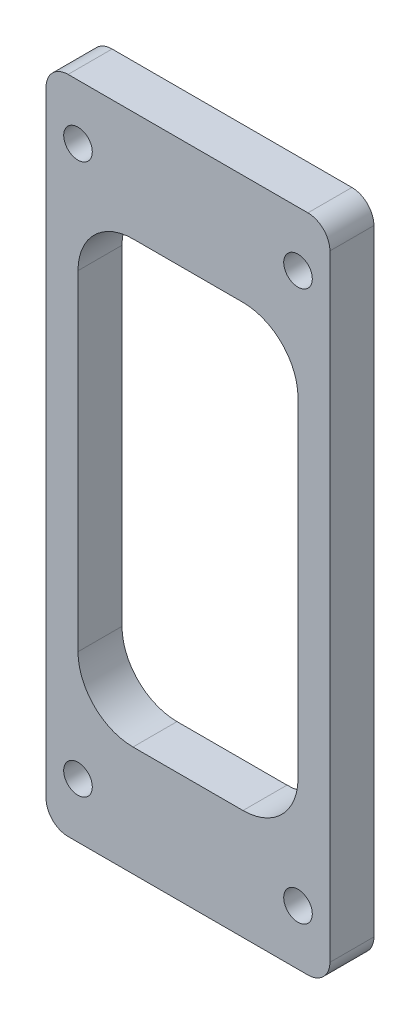
ISO-10303-21;
HEADER;
FILE_DESCRIPTION(('STEP AP214'),'2;1');
FILE_NAME('part.step','',(''),(''),'','','');
FILE_SCHEMA(('AUTOMOTIVE_DESIGN { 1 0 10303 214 1 1 1 1 }'));
ENDSEC;
DATA;
#1=APPLICATION_CONTEXT('core data for automotive mechanical design processes');
#2=APPLICATION_PROTOCOL_DEFINITION('international standard','automotive_design',2000,#1);
#3=PRODUCT_CONTEXT('',#1,'mechanical');
#4=PRODUCT('Part','Part','',(#3));
#5=PRODUCT_RELATED_PRODUCT_CATEGORY('part','',(#4));
#6=PRODUCT_DEFINITION_FORMATION('','',#4);
#7=PRODUCT_DEFINITION_CONTEXT('part definition',#1,'design');
#8=PRODUCT_DEFINITION('design','',#6,#7);
#9=PRODUCT_DEFINITION_SHAPE('','',#8);
#10=(LENGTH_UNIT() NAMED_UNIT(*) SI_UNIT(.MILLI.,.METRE.));
#11=(NAMED_UNIT(*) PLANE_ANGLE_UNIT() SI_UNIT($,.RADIAN.));
#12=(NAMED_UNIT(*) SI_UNIT($,.STERADIAN.) SOLID_ANGLE_UNIT());
#13=UNCERTAINTY_MEASURE_WITH_UNIT(LENGTH_MEASURE(1.E-05),#10,'distance_accuracy_value','');
#14=(GEOMETRIC_REPRESENTATION_CONTEXT(3) GLOBAL_UNCERTAINTY_ASSIGNED_CONTEXT((#13)) GLOBAL_UNIT_ASSIGNED_CONTEXT((#10,
#11,#12)) REPRESENTATION_CONTEXT('',''));
#15=CARTESIAN_POINT('',(0.,0.,0.));
#16=DIRECTION('',(0.,0.,1.));
#17=DIRECTION('',(1.,0.,0.));
#18=AXIS2_PLACEMENT_3D('',#15,#16,#17);
#19=CARTESIAN_POINT('',(12.9,30.,4.));
#20=DIRECTION('',(-1.,0.,0.));
#21=DIRECTION('',(0.,-1.,0.));
#22=AXIS2_PLACEMENT_3D('',#19,#20,#21);
#23=PLANE('',#22);
#24=DIRECTION('',(0.,1.,0.));
#25=VECTOR('',#24,1.);
#26=CARTESIAN_POINT('',(12.9,30.,4.));
#27=LINE('',#26,#25);
#28=CARTESIAN_POINT('',(12.9,-28.,4.));
#29=VERTEX_POINT('',#28);
#30=CARTESIAN_POINT('',(12.9,28.,4.));
#31=VERTEX_POINT('',#30);
#32=EDGE_CURVE('E242',#29,#31,#27,.T.);
#33=ORIENTED_EDGE('',*,*,#32,.F.);
#34=DIRECTION('',(0.,0.,-1.));
#35=VECTOR('',#34,1.);
#36=CARTESIAN_POINT('',(12.9,-28.,4.));
#37=LINE('',#36,#35);
#38=CARTESIAN_POINT('',(12.9,-28.,0.));
#39=VERTEX_POINT('',#38);
#40=EDGE_CURVE('E12',#29,#39,#37,.T.);
#41=ORIENTED_EDGE('',*,*,#40,.T.);
#42=DIRECTION('',(0.,1.,0.));
#43=VECTOR('',#42,1.);
#44=CARTESIAN_POINT('',(12.9,30.,0.));
#45=LINE('',#44,#43);
#46=CARTESIAN_POINT('',(12.9,28.,0.));
#47=VERTEX_POINT('',#46);
#48=EDGE_CURVE('E240',#39,#47,#45,.T.);
#49=ORIENTED_EDGE('',*,*,#48,.T.);
#50=DIRECTION('',(0.,0.,-1.));
#51=VECTOR('',#50,1.);
#52=CARTESIAN_POINT('',(12.9,28.,4.));
#53=LINE('',#52,#51);
#54=EDGE_CURVE('E51',#47,#31,#53,.F.);
#55=ORIENTED_EDGE('',*,*,#54,.T.);
#56=EDGE_LOOP('',(#33,#41,#49,#55));
#57=FACE_BOUND('',#56,.T.);
#58=ADVANCED_FACE('F43',(#57),#23,.F.);
#59=CARTESIAN_POINT('',(-12.9,30.,4.));
#60=DIRECTION('',(0.,-1.,0.));
#61=DIRECTION('',(0.,0.,-1.));
#62=AXIS2_PLACEMENT_3D('',#59,#60,#61);
#63=PLANE('',#62);
#64=DIRECTION('',(-1.,0.,0.));
#65=VECTOR('',#64,1.);
#66=CARTESIAN_POINT('',(-12.9,30.,0.));
#67=LINE('',#66,#65);
#68=CARTESIAN_POINT('',(10.9,30.,0.));
#69=VERTEX_POINT('',#68);
#70=CARTESIAN_POINT('',(-10.9,30.,0.));
#71=VERTEX_POINT('',#70);
#72=EDGE_CURVE('E259',#69,#71,#67,.T.);
#73=ORIENTED_EDGE('',*,*,#72,.T.);
#74=DIRECTION('',(0.,0.,-1.));
#75=VECTOR('',#74,1.);
#76=CARTESIAN_POINT('',(-10.9,30.,4.));
#77=LINE('',#76,#75);
#78=CARTESIAN_POINT('',(-10.9,30.,4.));
#79=VERTEX_POINT('',#78);
#80=EDGE_CURVE('E296',#71,#79,#77,.F.);
#81=ORIENTED_EDGE('',*,*,#80,.T.);
#82=DIRECTION('',(-1.,0.,0.));
#83=VECTOR('',#82,1.);
#84=CARTESIAN_POINT('',(-12.9,30.,4.));
#85=LINE('',#84,#83);
#86=CARTESIAN_POINT('',(10.9,30.,4.));
#87=VERTEX_POINT('',#86);
#88=EDGE_CURVE('E246',#87,#79,#85,.T.);
#89=ORIENTED_EDGE('',*,*,#88,.F.);
#90=DIRECTION('',(0.,0.,-1.));
#91=VECTOR('',#90,1.);
#92=CARTESIAN_POINT('',(10.9,30.,4.));
#93=LINE('',#92,#91);
#94=EDGE_CURVE('E293',#87,#69,#93,.T.);
#95=ORIENTED_EDGE('',*,*,#94,.T.);
#96=EDGE_LOOP('',(#73,#81,#89,#95));
#97=FACE_BOUND('',#96,.T.);
#98=ADVANCED_FACE('F311',(#97),#63,.F.);
#99=CARTESIAN_POINT('',(-12.9,30.,4.));
#100=DIRECTION('',(1.,0.,0.));
#101=DIRECTION('',(0.,1.,0.));
#102=AXIS2_PLACEMENT_3D('',#99,#100,#101);
#103=PLANE('',#102);
#104=DIRECTION('',(0.,-1.,0.));
#105=VECTOR('',#104,1.);
#106=CARTESIAN_POINT('',(-12.9,30.,0.));
#107=LINE('',#106,#105);
#108=CARTESIAN_POINT('',(-12.9,28.,0.));
#109=VERTEX_POINT('',#108);
#110=CARTESIAN_POINT('',(-12.9,-28.,0.));
#111=VERTEX_POINT('',#110);
#112=EDGE_CURVE('E262',#109,#111,#107,.T.);
#113=ORIENTED_EDGE('',*,*,#112,.T.);
#114=DIRECTION('',(0.,0.,-1.));
#115=VECTOR('',#114,1.);
#116=CARTESIAN_POINT('',(-12.9,-28.,4.));
#117=LINE('',#116,#115);
#118=CARTESIAN_POINT('',(-12.9,-28.,4.));
#119=VERTEX_POINT('',#118);
#120=EDGE_CURVE('E283',#111,#119,#117,.F.);
#121=ORIENTED_EDGE('',*,*,#120,.T.);
#122=DIRECTION('',(0.,-1.,0.));
#123=VECTOR('',#122,1.);
#124=CARTESIAN_POINT('',(-12.9,30.,4.));
#125=LINE('',#124,#123);
#126=CARTESIAN_POINT('',(-12.9,28.,4.));
#127=VERTEX_POINT('',#126);
#128=EDGE_CURVE('E250',#127,#119,#125,.T.);
#129=ORIENTED_EDGE('',*,*,#128,.F.);
#130=DIRECTION('',(0.,0.,-1.));
#131=VECTOR('',#130,1.);
#132=CARTESIAN_POINT('',(-12.9,28.,4.));
#133=LINE('',#132,#131);
#134=EDGE_CURVE('E280',#127,#109,#133,.T.);
#135=ORIENTED_EDGE('',*,*,#134,.T.);
#136=EDGE_LOOP('',(#113,#121,#129,#135));
#137=FACE_BOUND('',#136,.T.);
#138=ADVANCED_FACE('F322',(#137),#103,.F.);
#139=CARTESIAN_POINT('',(-12.9,-30.,4.));
#140=DIRECTION('',(0.,1.,0.));
#141=DIRECTION('',(0.,0.,1.));
#142=AXIS2_PLACEMENT_3D('',#139,#140,#141);
#143=PLANE('',#142);
#144=DIRECTION('',(1.,0.,0.));
#145=VECTOR('',#144,1.);
#146=CARTESIAN_POINT('',(-12.9,-30.,4.));
#147=LINE('',#146,#145);
#148=CARTESIAN_POINT('',(-10.9,-30.,4.));
#149=VERTEX_POINT('',#148);
#150=CARTESIAN_POINT('',(10.9,-30.,4.));
#151=VERTEX_POINT('',#150);
#152=EDGE_CURVE('E253',#149,#151,#147,.T.);
#153=ORIENTED_EDGE('',*,*,#152,.F.);
#154=DIRECTION('',(0.,0.,-1.));
#155=VECTOR('',#154,1.);
#156=CARTESIAN_POINT('',(-10.9,-30.,4.));
#157=LINE('',#156,#155);
#158=CARTESIAN_POINT('',(-10.9,-30.,0.));
#159=VERTEX_POINT('',#158);
#160=EDGE_CURVE('E268',#149,#159,#157,.T.);
#161=ORIENTED_EDGE('',*,*,#160,.T.);
#162=DIRECTION('',(1.,0.,0.));
#163=VECTOR('',#162,1.);
#164=CARTESIAN_POINT('',(-12.9,-30.,0.));
#165=LINE('',#164,#163);
#166=CARTESIAN_POINT('',(10.9,-30.,0.));
#167=VERTEX_POINT('',#166);
#168=EDGE_CURVE('E247',#159,#167,#165,.T.);
#169=ORIENTED_EDGE('',*,*,#168,.T.);
#170=DIRECTION('',(0.,0.,-1.));
#171=VECTOR('',#170,1.);
#172=CARTESIAN_POINT('',(10.9,-30.,4.));
#173=LINE('',#172,#171);
#174=EDGE_CURVE('E256',#167,#151,#173,.F.);
#175=ORIENTED_EDGE('',*,*,#174,.T.);
#176=EDGE_LOOP('',(#153,#161,#169,#175));
#177=FACE_BOUND('',#176,.T.);
#178=ADVANCED_FACE('F330',(#177),#143,.F.);
#179=CARTESIAN_POINT('',(0.,0.,4.));
#180=DIRECTION('',(0.,0.,1.));
#181=DIRECTION('',(1.,0.,0.));
#182=AXIS2_PLACEMENT_3D('',#179,#180,#181);
#183=PLANE('',#182);
#184=CARTESIAN_POINT('',(5.,15.,4.));
#185=DIRECTION('',(0.,0.,1.));
#186=DIRECTION('',(-1.,0.,0.));
#187=AXIS2_PLACEMENT_3D('',#184,#185,#186);
#188=CIRCLE('',#187,5.);
#189=CARTESIAN_POINT('',(10.,15.,4.));
#190=VERTEX_POINT('',#189);
#191=CARTESIAN_POINT('',(4.99999999999996,20.,4.));
#192=VERTEX_POINT('',#191);
#193=EDGE_CURVE('E58',#190,#192,#188,.T.);
#194=ORIENTED_EDGE('',*,*,#193,.F.);
#195=DIRECTION('',(0.,1.,0.));
#196=VECTOR('',#195,1.);
#197=CARTESIAN_POINT('',(10.,15.,4.));
#198=LINE('',#197,#196);
#199=CARTESIAN_POINT('',(10.,-15.,4.));
#200=VERTEX_POINT('',#199);
#201=EDGE_CURVE('E164',#200,#190,#198,.T.);
#202=ORIENTED_EDGE('',*,*,#201,.F.);
#203=CARTESIAN_POINT('',(5.,-15.,4.));
#204=DIRECTION('',(0.,0.,1.));
#205=DIRECTION('',(1.,0.,0.));
#206=AXIS2_PLACEMENT_3D('',#203,#204,#205);
#207=CIRCLE('',#206,5.);
#208=CARTESIAN_POINT('',(4.99999999999997,-20.,4.));
#209=VERTEX_POINT('',#208);
#210=EDGE_CURVE('E199',#209,#200,#207,.T.);
#211=ORIENTED_EDGE('',*,*,#210,.F.);
#212=DIRECTION('',(1.,0.,0.));
#213=VECTOR('',#212,1.);
#214=CARTESIAN_POINT('',(4.99999999999997,-20.,4.));
#215=LINE('',#214,#213);
#216=CARTESIAN_POINT('',(-4.99999999999996,-20.,4.));
#217=VERTEX_POINT('',#216);
#218=EDGE_CURVE('E196',#217,#209,#215,.T.);
#219=ORIENTED_EDGE('',*,*,#218,.F.);
#220=CARTESIAN_POINT('',(-5.,-15.,4.));
#221=DIRECTION('',(0.,0.,1.));
#222=DIRECTION('',(-1.,0.,0.));
#223=AXIS2_PLACEMENT_3D('',#220,#221,#222);
#224=CIRCLE('',#223,5.);
#225=CARTESIAN_POINT('',(-10.,-15.,4.));
#226=VERTEX_POINT('',#225);
#227=EDGE_CURVE('E193',#226,#217,#224,.T.);
#228=ORIENTED_EDGE('',*,*,#227,.F.);
#229=DIRECTION('',(0.,-1.,0.));
#230=VECTOR('',#229,1.);
#231=CARTESIAN_POINT('',(-10.,15.,4.));
#232=LINE('',#231,#230);
#233=CARTESIAN_POINT('',(-10.,15.,4.));
#234=VERTEX_POINT('',#233);
#235=EDGE_CURVE('E190',#234,#226,#232,.T.);
#236=ORIENTED_EDGE('',*,*,#235,.F.);
#237=CARTESIAN_POINT('',(-5.,15.,4.));
#238=DIRECTION('',(0.,0.,1.));
#239=DIRECTION('',(1.,0.,0.));
#240=AXIS2_PLACEMENT_3D('',#237,#238,#239);
#241=CIRCLE('',#240,5.);
#242=CARTESIAN_POINT('',(-4.99999999999996,20.,4.));
#243=VERTEX_POINT('',#242);
#244=EDGE_CURVE('E187',#243,#234,#241,.T.);
#245=ORIENTED_EDGE('',*,*,#244,.F.);
#246=DIRECTION('',(-1.,0.,0.));
#247=VECTOR('',#246,1.);
#248=CARTESIAN_POINT('',(4.99999999999996,20.,4.));
#249=LINE('',#248,#247);
#250=EDGE_CURVE('E180',#192,#243,#249,.T.);
#251=ORIENTED_EDGE('',*,*,#250,.F.);
#252=EDGE_LOOP('',(#194,#202,#211,#219,#228,#236,#245,#251));
#253=FACE_BOUND('',#252,.T.);
#254=CARTESIAN_POINT('',(-10.,25.,4.));
#255=DIRECTION('',(0.,0.,1.));
#256=DIRECTION('',(1.,0.,0.));
#257=AXIS2_PLACEMENT_3D('',#254,#255,#256);
#258=CIRCLE('',#257,1.29999999999999);
#259=CARTESIAN_POINT('',(-8.70000000000002,25.,4.));
#260=VERTEX_POINT('',#259);
#261=EDGE_CURVE('E171',#260,#260,#258,.T.);
#262=ORIENTED_EDGE('',*,*,#261,.F.);
#263=EDGE_LOOP('',(#262));
#264=FACE_BOUND('',#263,.T.);
#265=CARTESIAN_POINT('',(10.,25.,4.));
#266=DIRECTION('',(0.,0.,1.));
#267=DIRECTION('',(1.,0.,0.));
#268=AXIS2_PLACEMENT_3D('',#265,#266,#267);
#269=CIRCLE('',#268,1.29999999999999);
#270=CARTESIAN_POINT('',(11.3,25.,4.));
#271=VERTEX_POINT('',#270);
#272=EDGE_CURVE('E224',#271,#271,#269,.T.);
#273=ORIENTED_EDGE('',*,*,#272,.F.);
#274=EDGE_LOOP('',(#273));
#275=FACE_BOUND('',#274,.T.);
#276=CARTESIAN_POINT('',(10.,-25.,4.));
#277=DIRECTION('',(0.,0.,1.));
#278=DIRECTION('',(1.,0.,0.));
#279=AXIS2_PLACEMENT_3D('',#276,#277,#278);
#280=CIRCLE('',#279,1.29999999999999);
#281=CARTESIAN_POINT('',(11.3,-25.,4.));
#282=VERTEX_POINT('',#281);
#283=EDGE_CURVE('E565',#282,#282,#280,.T.);
#284=ORIENTED_EDGE('',*,*,#283,.F.);
#285=EDGE_LOOP('',(#284));
#286=FACE_BOUND('',#285,.T.);
#287=CARTESIAN_POINT('',(-10.,-25.,4.));
#288=DIRECTION('',(0.,0.,1.));
#289=DIRECTION('',(1.,0.,0.));
#290=AXIS2_PLACEMENT_3D('',#287,#288,#289);
#291=CIRCLE('',#290,1.29999999999999);
#292=CARTESIAN_POINT('',(-8.70000000000001,-25.,4.));
#293=VERTEX_POINT('',#292);
#294=EDGE_CURVE('E241',#293,#293,#291,.T.);
#295=ORIENTED_EDGE('',*,*,#294,.F.);
#296=EDGE_LOOP('',(#295));
#297=FACE_BOUND('',#296,.T.);
#298=ORIENTED_EDGE('',*,*,#128,.T.);
#299=CARTESIAN_POINT('',(-10.9,-28.,4.));
#300=DIRECTION('',(0.,0.,1.));
#301=DIRECTION('',(1.,0.,0.));
#302=AXIS2_PLACEMENT_3D('',#299,#300,#301);
#303=CIRCLE('',#302,2.);
#304=EDGE_CURVE('E291',#119,#149,#303,.T.);
#305=ORIENTED_EDGE('',*,*,#304,.T.);
#306=ORIENTED_EDGE('',*,*,#152,.T.);
#307=CARTESIAN_POINT('',(10.9,-28.,4.));
#308=DIRECTION('',(0.,0.,1.));
#309=DIRECTION('',(1.,0.,0.));
#310=AXIS2_PLACEMENT_3D('',#307,#308,#309);
#311=CIRCLE('',#310,2.);
#312=EDGE_CURVE('E287',#151,#29,#311,.T.);
#313=ORIENTED_EDGE('',*,*,#312,.T.);
#314=ORIENTED_EDGE('',*,*,#32,.T.);
#315=CARTESIAN_POINT('',(10.9,28.,4.));
#316=DIRECTION('',(0.,0.,1.));
#317=DIRECTION('',(1.,0.,0.));
#318=AXIS2_PLACEMENT_3D('',#315,#316,#317);
#319=CIRCLE('',#318,2.);
#320=EDGE_CURVE('E285',#31,#87,#319,.T.);
#321=ORIENTED_EDGE('',*,*,#320,.T.);
#322=ORIENTED_EDGE('',*,*,#88,.T.);
#323=CARTESIAN_POINT('',(-10.9,28.,4.));
#324=DIRECTION('',(0.,0.,1.));
#325=DIRECTION('',(1.,0.,0.));
#326=AXIS2_PLACEMENT_3D('',#323,#324,#325);
#327=CIRCLE('',#326,2.);
#328=EDGE_CURVE('E289',#79,#127,#327,.T.);
#329=ORIENTED_EDGE('',*,*,#328,.T.);
#330=EDGE_LOOP('',(#298,#305,#306,#313,#314,#321,#322,#329));
#331=FACE_BOUND('',#330,.T.);
#332=ADVANCED_FACE('F305',(#253,#264,#275,#286,#297,#331),#183,.T.);
#333=CARTESIAN_POINT('',(0.,0.,0.));
#334=DIRECTION('',(0.,0.,1.));
#335=DIRECTION('',(1.,0.,0.));
#336=AXIS2_PLACEMENT_3D('',#333,#334,#335);
#337=PLANE('',#336);
#338=DIRECTION('',(0.,-1.,0.));
#339=VECTOR('',#338,1.);
#340=CARTESIAN_POINT('',(10.,15.,0.));
#341=LINE('',#340,#339);
#342=CARTESIAN_POINT('',(10.,15.,0.));
#343=VERTEX_POINT('',#342);
#344=CARTESIAN_POINT('',(10.,-15.,0.));
#345=VERTEX_POINT('',#344);
#346=EDGE_CURVE('E178',#343,#345,#341,.T.);
#347=ORIENTED_EDGE('',*,*,#346,.F.);
#348=CARTESIAN_POINT('',(5.,15.,0.));
#349=DIRECTION('',(0.,0.,1.));
#350=DIRECTION('',(1.,0.,0.));
#351=AXIS2_PLACEMENT_3D('',#348,#349,#350);
#352=CIRCLE('',#351,5.);
#353=CARTESIAN_POINT('',(4.99999999999996,20.,0.));
#354=VERTEX_POINT('',#353);
#355=EDGE_CURVE('E158',#354,#343,#352,.F.);
#356=ORIENTED_EDGE('',*,*,#355,.F.);
#357=DIRECTION('',(1.,0.,0.));
#358=VECTOR('',#357,1.);
#359=CARTESIAN_POINT('',(4.99999999999996,20.,0.));
#360=LINE('',#359,#358);
#361=CARTESIAN_POINT('',(-4.99999999999996,20.,0.));
#362=VERTEX_POINT('',#361);
#363=EDGE_CURVE('E167',#362,#354,#360,.T.);
#364=ORIENTED_EDGE('',*,*,#363,.F.);
#365=CARTESIAN_POINT('',(-5.,15.,0.));
#366=DIRECTION('',(0.,0.,1.));
#367=DIRECTION('',(1.,0.,0.));
#368=AXIS2_PLACEMENT_3D('',#365,#366,#367);
#369=CIRCLE('',#368,5.);
#370=CARTESIAN_POINT('',(-10.,15.,0.));
#371=VERTEX_POINT('',#370);
#372=EDGE_CURVE('E66',#371,#362,#369,.F.);
#373=ORIENTED_EDGE('',*,*,#372,.F.);
#374=DIRECTION('',(0.,1.,0.));
#375=VECTOR('',#374,1.);
#376=CARTESIAN_POINT('',(-10.,15.,0.));
#377=LINE('',#376,#375);
#378=CARTESIAN_POINT('',(-10.,-15.,0.));
#379=VERTEX_POINT('',#378);
#380=EDGE_CURVE('E535',#379,#371,#377,.T.);
#381=ORIENTED_EDGE('',*,*,#380,.F.);
#382=CARTESIAN_POINT('',(-5.,-15.,0.));
#383=DIRECTION('',(0.,0.,1.));
#384=DIRECTION('',(1.,0.,0.));
#385=AXIS2_PLACEMENT_3D('',#382,#383,#384);
#386=CIRCLE('',#385,5.);
#387=CARTESIAN_POINT('',(-4.99999999999996,-20.,0.));
#388=VERTEX_POINT('',#387);
#389=EDGE_CURVE('E539',#388,#379,#386,.F.);
#390=ORIENTED_EDGE('',*,*,#389,.F.);
#391=DIRECTION('',(-1.,0.,0.));
#392=VECTOR('',#391,1.);
#393=CARTESIAN_POINT('',(4.99999999999997,-20.,0.));
#394=LINE('',#393,#392);
#395=CARTESIAN_POINT('',(4.99999999999997,-20.,0.));
#396=VERTEX_POINT('',#395);
#397=EDGE_CURVE('E546',#396,#388,#394,.T.);
#398=ORIENTED_EDGE('',*,*,#397,.F.);
#399=CARTESIAN_POINT('',(5.,-15.,0.));
#400=DIRECTION('',(0.,0.,1.));
#401=DIRECTION('',(1.,0.,0.));
#402=AXIS2_PLACEMENT_3D('',#399,#400,#401);
#403=CIRCLE('',#402,5.);
#404=EDGE_CURVE('E182',#345,#396,#403,.F.);
#405=ORIENTED_EDGE('',*,*,#404,.F.);
#406=EDGE_LOOP('',(#347,#356,#364,#373,#381,#390,#398,#405));
#407=FACE_BOUND('',#406,.T.);
#408=CARTESIAN_POINT('',(-10.,25.,0.));
#409=DIRECTION('',(0.,0.,1.));
#410=DIRECTION('',(1.,0.,0.));
#411=AXIS2_PLACEMENT_3D('',#408,#409,#410);
#412=CIRCLE('',#411,1.3);
#413=CARTESIAN_POINT('',(-8.7,25.,0.));
#414=VERTEX_POINT('',#413);
#415=EDGE_CURVE('E219',#414,#414,#412,.T.);
#416=ORIENTED_EDGE('',*,*,#415,.T.);
#417=EDGE_LOOP('',(#416));
#418=FACE_BOUND('',#417,.T.);
#419=CARTESIAN_POINT('',(10.,25.,0.));
#420=DIRECTION('',(0.,0.,1.));
#421=DIRECTION('',(1.,0.,0.));
#422=AXIS2_PLACEMENT_3D('',#419,#420,#421);
#423=CIRCLE('',#422,1.3);
#424=CARTESIAN_POINT('',(11.3,25.,0.));
#425=VERTEX_POINT('',#424);
#426=EDGE_CURVE('E574',#425,#425,#423,.T.);
#427=ORIENTED_EDGE('',*,*,#426,.T.);
#428=EDGE_LOOP('',(#427));
#429=FACE_BOUND('',#428,.T.);
#430=CARTESIAN_POINT('',(10.,-25.,0.));
#431=DIRECTION('',(0.,0.,1.));
#432=DIRECTION('',(1.,0.,0.));
#433=AXIS2_PLACEMENT_3D('',#430,#431,#432);
#434=CIRCLE('',#433,1.3);
#435=CARTESIAN_POINT('',(11.3,-25.,0.));
#436=VERTEX_POINT('',#435);
#437=EDGE_CURVE('E569',#436,#436,#434,.T.);
#438=ORIENTED_EDGE('',*,*,#437,.T.);
#439=EDGE_LOOP('',(#438));
#440=FACE_BOUND('',#439,.T.);
#441=CARTESIAN_POINT('',(-10.,-25.,0.));
#442=DIRECTION('',(0.,0.,1.));
#443=DIRECTION('',(1.,0.,0.));
#444=AXIS2_PLACEMENT_3D('',#441,#442,#443);
#445=CIRCLE('',#444,1.3);
#446=CARTESIAN_POINT('',(-8.7,-25.,0.));
#447=VERTEX_POINT('',#446);
#448=EDGE_CURVE('E234',#447,#447,#445,.T.);
#449=ORIENTED_EDGE('',*,*,#448,.T.);
#450=EDGE_LOOP('',(#449));
#451=FACE_BOUND('',#450,.T.);
#452=ORIENTED_EDGE('',*,*,#168,.F.);
#453=CARTESIAN_POINT('',(-10.9,-28.,0.));
#454=DIRECTION('',(0.,0.,1.));
#455=DIRECTION('',(1.,0.,0.));
#456=AXIS2_PLACEMENT_3D('',#453,#454,#455);
#457=CIRCLE('',#456,2.);
#458=EDGE_CURVE('E278',#159,#111,#457,.F.);
#459=ORIENTED_EDGE('',*,*,#458,.T.);
#460=ORIENTED_EDGE('',*,*,#112,.F.);
#461=CARTESIAN_POINT('',(-10.9,28.,0.));
#462=DIRECTION('',(0.,0.,1.));
#463=DIRECTION('',(1.,0.,0.));
#464=AXIS2_PLACEMENT_3D('',#461,#462,#463);
#465=CIRCLE('',#464,2.);
#466=EDGE_CURVE('E276',#109,#71,#465,.F.);
#467=ORIENTED_EDGE('',*,*,#466,.T.);
#468=ORIENTED_EDGE('',*,*,#72,.F.);
#469=CARTESIAN_POINT('',(10.9,28.,0.));
#470=DIRECTION('',(0.,0.,1.));
#471=DIRECTION('',(1.,0.,0.));
#472=AXIS2_PLACEMENT_3D('',#469,#470,#471);
#473=CIRCLE('',#472,2.);
#474=EDGE_CURVE('E271',#69,#47,#473,.F.);
#475=ORIENTED_EDGE('',*,*,#474,.T.);
#476=ORIENTED_EDGE('',*,*,#48,.F.);
#477=CARTESIAN_POINT('',(10.9,-28.,0.));
#478=DIRECTION('',(0.,0.,1.));
#479=DIRECTION('',(1.,0.,0.));
#480=AXIS2_PLACEMENT_3D('',#477,#478,#479);
#481=CIRCLE('',#480,2.);
#482=EDGE_CURVE('E274',#39,#167,#481,.F.);
#483=ORIENTED_EDGE('',*,*,#482,.T.);
#484=EDGE_LOOP('',(#452,#459,#460,#467,#468,#475,#476,#483));
#485=FACE_BOUND('',#484,.T.);
#486=ADVANCED_FACE('F174',(#407,#418,#429,#440,#451,#485),#337,.F.);
#487=CARTESIAN_POINT('',(-10.,-25.,4.));
#488=DIRECTION('',(0.,0.,1.));
#489=DIRECTION('',(1.,0.,0.));
#490=AXIS2_PLACEMENT_3D('',#487,#488,#489);
#491=CYLINDRICAL_SURFACE('',#490,1.29999999999999);
#492=ORIENTED_EDGE('',*,*,#448,.F.);
#493=EDGE_LOOP('',(#492));
#494=FACE_BOUND('',#493,.T.);
#495=ORIENTED_EDGE('',*,*,#294,.T.);
#496=EDGE_LOOP('',(#495));
#497=FACE_BOUND('',#496,.T.);
#498=ADVANCED_FACE('F369',(#494,#497),#491,.F.);
#499=CARTESIAN_POINT('',(10.,-25.,4.));
#500=DIRECTION('',(0.,0.,1.));
#501=DIRECTION('',(1.,0.,0.));
#502=AXIS2_PLACEMENT_3D('',#499,#500,#501);
#503=CYLINDRICAL_SURFACE('',#502,1.29999999999999);
#504=ORIENTED_EDGE('',*,*,#437,.F.);
#505=EDGE_LOOP('',(#504));
#506=FACE_BOUND('',#505,.T.);
#507=ORIENTED_EDGE('',*,*,#283,.T.);
#508=EDGE_LOOP('',(#507));
#509=FACE_BOUND('',#508,.T.);
#510=ADVANCED_FACE('F359',(#506,#509),#503,.F.);
#511=CARTESIAN_POINT('',(10.,25.,4.));
#512=DIRECTION('',(0.,0.,1.));
#513=DIRECTION('',(1.,0.,0.));
#514=AXIS2_PLACEMENT_3D('',#511,#512,#513);
#515=CYLINDRICAL_SURFACE('',#514,1.29999999999999);
#516=ORIENTED_EDGE('',*,*,#426,.F.);
#517=EDGE_LOOP('',(#516));
#518=FACE_BOUND('',#517,.T.);
#519=ORIENTED_EDGE('',*,*,#272,.T.);
#520=EDGE_LOOP('',(#519));
#521=FACE_BOUND('',#520,.T.);
#522=ADVANCED_FACE('F353',(#518,#521),#515,.F.);
#523=CARTESIAN_POINT('',(-10.,25.,4.));
#524=DIRECTION('',(0.,0.,1.));
#525=DIRECTION('',(1.,0.,0.));
#526=AXIS2_PLACEMENT_3D('',#523,#524,#525);
#527=CYLINDRICAL_SURFACE('',#526,1.29999999999999);
#528=ORIENTED_EDGE('',*,*,#415,.F.);
#529=EDGE_LOOP('',(#528));
#530=FACE_BOUND('',#529,.T.);
#531=ORIENTED_EDGE('',*,*,#261,.T.);
#532=EDGE_LOOP('',(#531));
#533=FACE_BOUND('',#532,.T.);
#534=ADVANCED_FACE('F349',(#530,#533),#527,.F.);
#535=CARTESIAN_POINT('',(-10.9,-28.,4.));
#536=DIRECTION('',(0.,0.,-1.));
#537=DIRECTION('',(-1.,0.,0.));
#538=AXIS2_PLACEMENT_3D('',#535,#536,#537);
#539=CYLINDRICAL_SURFACE('',#538,2.);
#540=ORIENTED_EDGE('',*,*,#304,.F.);
#541=ORIENTED_EDGE('',*,*,#120,.F.);
#542=ORIENTED_EDGE('',*,*,#458,.F.);
#543=ORIENTED_EDGE('',*,*,#160,.F.);
#544=EDGE_LOOP('',(#540,#541,#542,#543));
#545=FACE_BOUND('',#544,.T.);
#546=ADVANCED_FACE('F328',(#545),#539,.T.);
#547=CARTESIAN_POINT('',(-10.9,28.,4.));
#548=DIRECTION('',(0.,0.,-1.));
#549=DIRECTION('',(-1.,0.,0.));
#550=AXIS2_PLACEMENT_3D('',#547,#548,#549);
#551=CYLINDRICAL_SURFACE('',#550,2.);
#552=ORIENTED_EDGE('',*,*,#328,.F.);
#553=ORIENTED_EDGE('',*,*,#80,.F.);
#554=ORIENTED_EDGE('',*,*,#466,.F.);
#555=ORIENTED_EDGE('',*,*,#134,.F.);
#556=EDGE_LOOP('',(#552,#553,#554,#555));
#557=FACE_BOUND('',#556,.T.);
#558=ADVANCED_FACE('F319',(#557),#551,.T.);
#559=CARTESIAN_POINT('',(10.9,-28.,4.));
#560=DIRECTION('',(0.,0.,-1.));
#561=DIRECTION('',(-1.,0.,0.));
#562=AXIS2_PLACEMENT_3D('',#559,#560,#561);
#563=CYLINDRICAL_SURFACE('',#562,2.);
#564=ORIENTED_EDGE('',*,*,#312,.F.);
#565=ORIENTED_EDGE('',*,*,#174,.F.);
#566=ORIENTED_EDGE('',*,*,#482,.F.);
#567=ORIENTED_EDGE('',*,*,#40,.F.);
#568=EDGE_LOOP('',(#564,#565,#566,#567));
#569=FACE_BOUND('',#568,.T.);
#570=ADVANCED_FACE('F333',(#569),#563,.T.);
#571=CARTESIAN_POINT('',(10.9,28.,4.));
#572=DIRECTION('',(0.,0.,-1.));
#573=DIRECTION('',(-1.,0.,0.));
#574=AXIS2_PLACEMENT_3D('',#571,#572,#573);
#575=CYLINDRICAL_SURFACE('',#574,2.);
#576=ORIENTED_EDGE('',*,*,#320,.F.);
#577=ORIENTED_EDGE('',*,*,#54,.F.);
#578=ORIENTED_EDGE('',*,*,#474,.F.);
#579=ORIENTED_EDGE('',*,*,#94,.F.);
#580=EDGE_LOOP('',(#576,#577,#578,#579));
#581=FACE_BOUND('',#580,.T.);
#582=ADVANCED_FACE('F45',(#581),#575,.T.);
#583=CARTESIAN_POINT('',(5.,15.,-0.00100000000000013));
#584=DIRECTION('',(0.,0.,1.));
#585=DIRECTION('',(1.,0.,0.));
#586=AXIS2_PLACEMENT_3D('',#583,#584,#585);
#587=CYLINDRICAL_SURFACE('',#586,5.);
#588=ORIENTED_EDGE('',*,*,#355,.T.);
#589=DIRECTION('',(0.,0.,1.));
#590=VECTOR('',#589,1.);
#591=CARTESIAN_POINT('',(10.,15.,-0.00100000000000013));
#592=LINE('',#591,#590);
#593=EDGE_CURVE('E172',#343,#190,#592,.T.);
#594=ORIENTED_EDGE('',*,*,#593,.T.);
#595=ORIENTED_EDGE('',*,*,#193,.T.);
#596=DIRECTION('',(0.,0.,1.));
#597=VECTOR('',#596,1.);
#598=CARTESIAN_POINT('',(4.99999999999996,20.,-0.00100000000000013));
#599=LINE('',#598,#597);
#600=EDGE_CURVE('E154',#354,#192,#599,.T.);
#601=ORIENTED_EDGE('',*,*,#600,.F.);
#602=EDGE_LOOP('',(#588,#594,#595,#601));
#603=FACE_BOUND('',#602,.T.);
#604=ADVANCED_FACE('F156',(#603),#587,.F.);
#605=CARTESIAN_POINT('',(10.,15.,-0.00100000000000013));
#606=DIRECTION('',(1.,0.,0.));
#607=DIRECTION('',(0.,1.,0.));
#608=AXIS2_PLACEMENT_3D('',#605,#606,#607);
#609=PLANE('',#608);
#610=ORIENTED_EDGE('',*,*,#346,.T.);
#611=DIRECTION('',(0.,0.,1.));
#612=VECTOR('',#611,1.);
#613=CARTESIAN_POINT('',(10.,-15.,-0.00100000000000013));
#614=LINE('',#613,#612);
#615=EDGE_CURVE('E205',#345,#200,#614,.T.);
#616=ORIENTED_EDGE('',*,*,#615,.T.);
#617=ORIENTED_EDGE('',*,*,#201,.T.);
#618=ORIENTED_EDGE('',*,*,#593,.F.);
#619=EDGE_LOOP('',(#610,#616,#617,#618));
#620=FACE_BOUND('',#619,.T.);
#621=ADVANCED_FACE('F465',(#620),#609,.F.);
#622=CARTESIAN_POINT('',(5.,-15.,-0.00100000000000013));
#623=DIRECTION('',(0.,0.,1.));
#624=DIRECTION('',(1.,0.,0.));
#625=AXIS2_PLACEMENT_3D('',#622,#623,#624);
#626=CYLINDRICAL_SURFACE('',#625,5.);
#627=ORIENTED_EDGE('',*,*,#404,.T.);
#628=DIRECTION('',(0.,0.,1.));
#629=VECTOR('',#628,1.);
#630=CARTESIAN_POINT('',(4.99999999999997,-20.,-0.00100000000000013));
#631=LINE('',#630,#629);
#632=EDGE_CURVE('E207',#396,#209,#631,.T.);
#633=ORIENTED_EDGE('',*,*,#632,.T.);
#634=ORIENTED_EDGE('',*,*,#210,.T.);
#635=ORIENTED_EDGE('',*,*,#615,.F.);
#636=EDGE_LOOP('',(#627,#633,#634,#635));
#637=FACE_BOUND('',#636,.T.);
#638=ADVANCED_FACE('F470',(#637),#626,.F.);
#639=CARTESIAN_POINT('',(4.99999999999997,-20.,-0.00100000000000013));
#640=DIRECTION('',(0.,-1.,0.));
#641=DIRECTION('',(1.,0.,0.));
#642=AXIS2_PLACEMENT_3D('',#639,#640,#641);
#643=PLANE('',#642);
#644=ORIENTED_EDGE('',*,*,#397,.T.);
#645=DIRECTION('',(0.,0.,1.));
#646=VECTOR('',#645,1.);
#647=CARTESIAN_POINT('',(-4.99999999999996,-20.,-0.00100000000000013));
#648=LINE('',#647,#646);
#649=EDGE_CURVE('E209',#388,#217,#648,.T.);
#650=ORIENTED_EDGE('',*,*,#649,.T.);
#651=ORIENTED_EDGE('',*,*,#218,.T.);
#652=ORIENTED_EDGE('',*,*,#632,.F.);
#653=EDGE_LOOP('',(#644,#650,#651,#652));
#654=FACE_BOUND('',#653,.T.);
#655=ADVANCED_FACE('F478',(#654),#643,.F.);
#656=CARTESIAN_POINT('',(-5.,-15.,-0.00100000000000013));
#657=DIRECTION('',(0.,0.,1.));
#658=DIRECTION('',(1.,0.,0.));
#659=AXIS2_PLACEMENT_3D('',#656,#657,#658);
#660=CYLINDRICAL_SURFACE('',#659,5.);
#661=ORIENTED_EDGE('',*,*,#389,.T.);
#662=DIRECTION('',(0.,0.,1.));
#663=VECTOR('',#662,1.);
#664=CARTESIAN_POINT('',(-10.,-15.,-0.00100000000000013));
#665=LINE('',#664,#663);
#666=EDGE_CURVE('E212',#379,#226,#665,.T.);
#667=ORIENTED_EDGE('',*,*,#666,.T.);
#668=ORIENTED_EDGE('',*,*,#227,.T.);
#669=ORIENTED_EDGE('',*,*,#649,.F.);
#670=EDGE_LOOP('',(#661,#667,#668,#669));
#671=FACE_BOUND('',#670,.T.);
#672=ADVANCED_FACE('F486',(#671),#660,.F.);
#673=CARTESIAN_POINT('',(-10.,15.,-0.00100000000000013));
#674=DIRECTION('',(-1.,0.,0.));
#675=DIRECTION('',(0.,-1.,0.));
#676=AXIS2_PLACEMENT_3D('',#673,#674,#675);
#677=PLANE('',#676);
#678=ORIENTED_EDGE('',*,*,#380,.T.);
#679=DIRECTION('',(0.,0.,1.));
#680=VECTOR('',#679,1.);
#681=CARTESIAN_POINT('',(-10.,15.,-0.00100000000000013));
#682=LINE('',#681,#680);
#683=EDGE_CURVE('E214',#371,#234,#682,.T.);
#684=ORIENTED_EDGE('',*,*,#683,.T.);
#685=ORIENTED_EDGE('',*,*,#235,.T.);
#686=ORIENTED_EDGE('',*,*,#666,.F.);
#687=EDGE_LOOP('',(#678,#684,#685,#686));
#688=FACE_BOUND('',#687,.T.);
#689=ADVANCED_FACE('F494',(#688),#677,.F.);
#690=CARTESIAN_POINT('',(-5.,15.,-0.00100000000000013));
#691=DIRECTION('',(0.,0.,1.));
#692=DIRECTION('',(1.,0.,0.));
#693=AXIS2_PLACEMENT_3D('',#690,#691,#692);
#694=CYLINDRICAL_SURFACE('',#693,5.);
#695=ORIENTED_EDGE('',*,*,#372,.T.);
#696=DIRECTION('',(0.,0.,1.));
#697=VECTOR('',#696,1.);
#698=CARTESIAN_POINT('',(-4.99999999999996,20.,-0.00100000000000013));
#699=LINE('',#698,#697);
#700=EDGE_CURVE('E163',#362,#243,#699,.T.);
#701=ORIENTED_EDGE('',*,*,#700,.T.);
#702=ORIENTED_EDGE('',*,*,#244,.T.);
#703=ORIENTED_EDGE('',*,*,#683,.F.);
#704=EDGE_LOOP('',(#695,#701,#702,#703));
#705=FACE_BOUND('',#704,.T.);
#706=ADVANCED_FACE('F502',(#705),#694,.F.);
#707=CARTESIAN_POINT('',(4.99999999999996,20.,-0.00100000000000013));
#708=DIRECTION('',(0.,1.,0.));
#709=DIRECTION('',(-1.,0.,0.));
#710=AXIS2_PLACEMENT_3D('',#707,#708,#709);
#711=PLANE('',#710);
#712=ORIENTED_EDGE('',*,*,#363,.T.);
#713=ORIENTED_EDGE('',*,*,#600,.T.);
#714=ORIENTED_EDGE('',*,*,#250,.T.);
#715=ORIENTED_EDGE('',*,*,#700,.F.);
#716=EDGE_LOOP('',(#712,#713,#714,#715));
#717=FACE_BOUND('',#716,.T.);
#718=ADVANCED_FACE('F168',(#717),#711,.F.);
#719=CLOSED_SHELL('',(#58,#98,#138,#178,#332,#486,#498,#510,#522,#534,#546,#558,#570,#582,#604,
#621,#638,#655,#672,#689,#706,#718));
#720=MANIFOLD_SOLID_BREP('B2',#719);
#721=ADVANCED_BREP_SHAPE_REPRESENTATION('',(#18,#720),#14);
#722=SHAPE_DEFINITION_REPRESENTATION(#9,#721);
ENDSEC;
END-ISO-10303-21;
